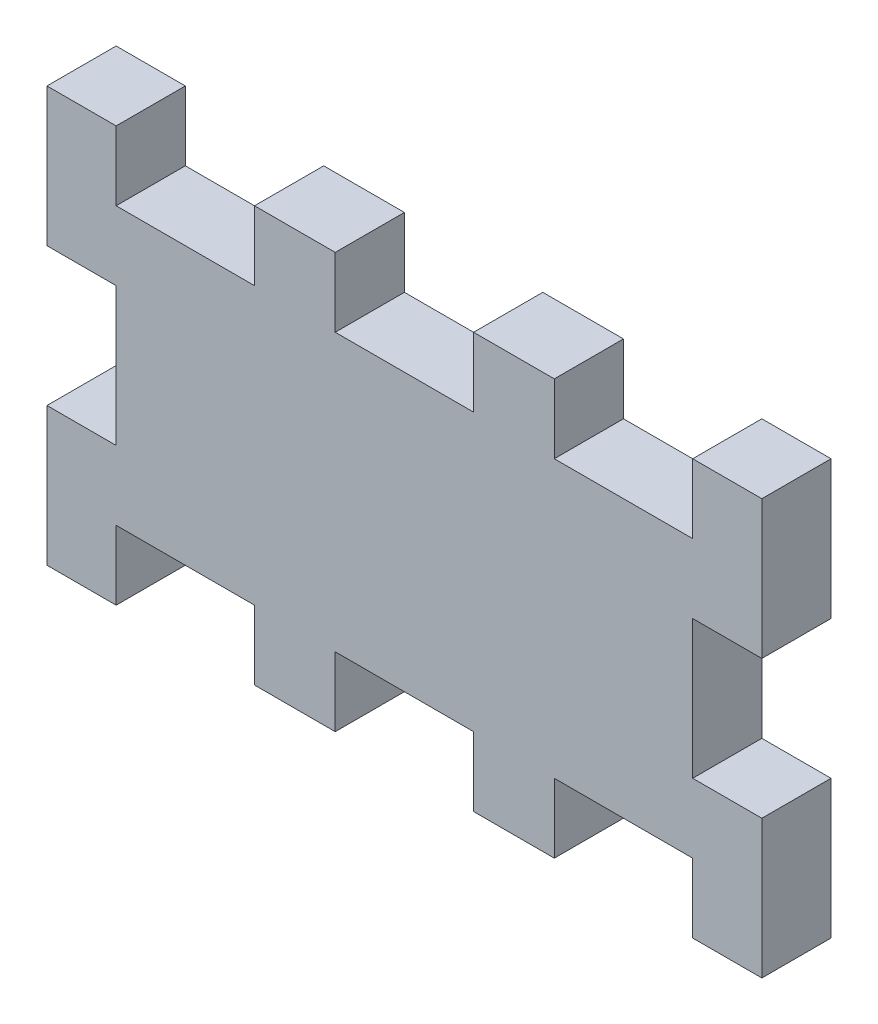
ISO-10303-21;
HEADER;
FILE_DESCRIPTION(('STEP AP214'),'2;1');
FILE_NAME('part.step','',(''),(''),'','','');
FILE_SCHEMA(('AUTOMOTIVE_DESIGN { 1 0 10303 214 1 1 1 1 }'));
ENDSEC;
DATA;
#1=APPLICATION_CONTEXT('core data for automotive mechanical design processes');
#2=APPLICATION_PROTOCOL_DEFINITION('international standard','automotive_design',2000,#1);
#3=PRODUCT_CONTEXT('',#1,'mechanical');
#4=PRODUCT('Part','Part','',(#3));
#5=PRODUCT_RELATED_PRODUCT_CATEGORY('part','',(#4));
#6=PRODUCT_DEFINITION_FORMATION('','',#4);
#7=PRODUCT_DEFINITION_CONTEXT('part definition',#1,'design');
#8=PRODUCT_DEFINITION('design','',#6,#7);
#9=PRODUCT_DEFINITION_SHAPE('','',#8);
#10=(LENGTH_UNIT() NAMED_UNIT(*) SI_UNIT(.MILLI.,.METRE.));
#11=(NAMED_UNIT(*) PLANE_ANGLE_UNIT() SI_UNIT($,.RADIAN.));
#12=(NAMED_UNIT(*) SI_UNIT($,.STERADIAN.) SOLID_ANGLE_UNIT());
#13=UNCERTAINTY_MEASURE_WITH_UNIT(LENGTH_MEASURE(1.E-05),#10,'distance_accuracy_value','');
#14=(GEOMETRIC_REPRESENTATION_CONTEXT(3) GLOBAL_UNCERTAINTY_ASSIGNED_CONTEXT((#13)) GLOBAL_UNIT_ASSIGNED_CONTEXT((#10,
#11,#12)) REPRESENTATION_CONTEXT('',''));
#15=CARTESIAN_POINT('',(0.,0.,0.));
#16=DIRECTION('',(0.,0.,1.));
#17=DIRECTION('',(1.,0.,0.));
#18=AXIS2_PLACEMENT_3D('',#15,#16,#17);
#19=CARTESIAN_POINT('',(-12.5,6.,3.));
#20=DIRECTION('',(-1.,0.,0.));
#21=DIRECTION('',(0.,-1.,0.));
#22=AXIS2_PLACEMENT_3D('',#19,#20,#21);
#23=PLANE('',#22);
#24=DIRECTION('',(0.,1.,0.));
#25=VECTOR('',#24,1.);
#26=CARTESIAN_POINT('',(-12.5,6.,0.));
#27=LINE('',#26,#25);
#28=CARTESIAN_POINT('',(-12.5,6.,0.));
#29=VERTEX_POINT('',#28);
#30=CARTESIAN_POINT('',(-12.5,9.,0.));
#31=VERTEX_POINT('',#30);
#32=EDGE_CURVE('E314',#29,#31,#27,.T.);
#33=ORIENTED_EDGE('',*,*,#32,.T.);
#34=DIRECTION('',(0.,0.,-1.));
#35=VECTOR('',#34,1.);
#36=CARTESIAN_POINT('',(-12.5,9.,3.));
#37=LINE('',#36,#35);
#38=CARTESIAN_POINT('',(-12.5,9.,3.));
#39=VERTEX_POINT('',#38);
#40=EDGE_CURVE('E11',#39,#31,#37,.T.);
#41=ORIENTED_EDGE('',*,*,#40,.F.);
#42=DIRECTION('',(0.,1.,0.));
#43=VECTOR('',#42,1.);
#44=CARTESIAN_POINT('',(-12.5,6.,3.));
#45=LINE('',#44,#43);
#46=CARTESIAN_POINT('',(-12.5,6.,3.));
#47=VERTEX_POINT('',#46);
#48=EDGE_CURVE('E420',#47,#39,#45,.T.);
#49=ORIENTED_EDGE('',*,*,#48,.F.);
#50=DIRECTION('',(0.,0.,-1.));
#51=VECTOR('',#50,1.);
#52=CARTESIAN_POINT('',(-12.5,6.,3.));
#53=LINE('',#52,#51);
#54=EDGE_CURVE('E310',#47,#29,#53,.T.);
#55=ORIENTED_EDGE('',*,*,#54,.T.);
#56=EDGE_LOOP('',(#33,#41,#49,#55));
#57=FACE_BOUND('',#56,.T.);
#58=ADVANCED_FACE('F45',(#57),#23,.F.);
#59=CARTESIAN_POINT('',(-12.5,9.,3.));
#60=DIRECTION('',(0.,-1.,0.));
#61=DIRECTION('',(1.,0.,0.));
#62=AXIS2_PLACEMENT_3D('',#59,#60,#61);
#63=PLANE('',#62);
#64=DIRECTION('',(-1.,0.,0.));
#65=VECTOR('',#64,1.);
#66=CARTESIAN_POINT('',(-12.5,9.,0.));
#67=LINE('',#66,#65);
#68=CARTESIAN_POINT('',(-15.5,9.,0.));
#69=VERTEX_POINT('',#68);
#70=EDGE_CURVE('E318',#31,#69,#67,.T.);
#71=ORIENTED_EDGE('',*,*,#70,.T.);
#72=DIRECTION('',(0.,0.,-1.));
#73=VECTOR('',#72,1.);
#74=CARTESIAN_POINT('',(-15.5,9.,3.));
#75=LINE('',#74,#73);
#76=CARTESIAN_POINT('',(-15.5,9.,3.));
#77=VERTEX_POINT('',#76);
#78=EDGE_CURVE('E54',#77,#69,#75,.T.);
#79=ORIENTED_EDGE('',*,*,#78,.F.);
#80=DIRECTION('',(-1.,0.,0.));
#81=VECTOR('',#80,1.);
#82=CARTESIAN_POINT('',(-12.5,9.,3.));
#83=LINE('',#82,#81);
#84=EDGE_CURVE('E189',#39,#77,#83,.T.);
#85=ORIENTED_EDGE('',*,*,#84,.F.);
#86=ORIENTED_EDGE('',*,*,#40,.T.);
#87=EDGE_LOOP('',(#71,#79,#85,#86));
#88=FACE_BOUND('',#87,.T.);
#89=ADVANCED_FACE('F682',(#88),#63,.F.);
#90=CARTESIAN_POINT('',(-15.5,3.,3.));
#91=DIRECTION('',(1.,0.,0.));
#92=DIRECTION('',(0.,0.,-1.));
#93=AXIS2_PLACEMENT_3D('',#90,#91,#92);
#94=PLANE('',#93);
#95=DIRECTION('',(0.,-1.,0.));
#96=VECTOR('',#95,1.);
#97=CARTESIAN_POINT('',(-15.5,3.,0.));
#98=LINE('',#97,#96);
#99=CARTESIAN_POINT('',(-15.5,3.,0.));
#100=VERTEX_POINT('',#99);
#101=EDGE_CURVE('E321',#69,#100,#98,.T.);
#102=ORIENTED_EDGE('',*,*,#101,.T.);
#103=DIRECTION('',(0.,0.,-1.));
#104=VECTOR('',#103,1.);
#105=CARTESIAN_POINT('',(-15.5,3.,3.));
#106=LINE('',#105,#104);
#107=CARTESIAN_POINT('',(-15.5,3.,3.));
#108=VERTEX_POINT('',#107);
#109=EDGE_CURVE('E543',#108,#100,#106,.T.);
#110=ORIENTED_EDGE('',*,*,#109,.F.);
#111=DIRECTION('',(0.,-1.,0.));
#112=VECTOR('',#111,1.);
#113=CARTESIAN_POINT('',(-15.5,3.,3.));
#114=LINE('',#113,#112);
#115=EDGE_CURVE('E553',#77,#108,#114,.T.);
#116=ORIENTED_EDGE('',*,*,#115,.F.);
#117=ORIENTED_EDGE('',*,*,#78,.T.);
#118=EDGE_LOOP('',(#102,#110,#116,#117));
#119=FACE_BOUND('',#118,.T.);
#120=ADVANCED_FACE('F551',(#119),#94,.F.);
#121=CARTESIAN_POINT('',(-12.5,3.,3.));
#122=DIRECTION('',(0.,1.,0.));
#123=DIRECTION('',(-1.,0.,0.));
#124=AXIS2_PLACEMENT_3D('',#121,#122,#123);
#125=PLANE('',#124);
#126=DIRECTION('',(1.,0.,0.));
#127=VECTOR('',#126,1.);
#128=CARTESIAN_POINT('',(-12.5,3.,0.));
#129=LINE('',#128,#127);
#130=CARTESIAN_POINT('',(-12.5,3.,0.));
#131=VERTEX_POINT('',#130);
#132=EDGE_CURVE('E324',#100,#131,#129,.T.);
#133=ORIENTED_EDGE('',*,*,#132,.T.);
#134=DIRECTION('',(0.,0.,-1.));
#135=VECTOR('',#134,1.);
#136=CARTESIAN_POINT('',(-12.5,3.,3.));
#137=LINE('',#136,#135);
#138=CARTESIAN_POINT('',(-12.5,3.,3.));
#139=VERTEX_POINT('',#138);
#140=EDGE_CURVE('E539',#139,#131,#137,.T.);
#141=ORIENTED_EDGE('',*,*,#140,.F.);
#142=DIRECTION('',(1.,0.,0.));
#143=VECTOR('',#142,1.);
#144=CARTESIAN_POINT('',(-12.5,3.,3.));
#145=LINE('',#144,#143);
#146=EDGE_CURVE('E572',#108,#139,#145,.T.);
#147=ORIENTED_EDGE('',*,*,#146,.F.);
#148=ORIENTED_EDGE('',*,*,#109,.T.);
#149=EDGE_LOOP('',(#133,#141,#147,#148));
#150=FACE_BOUND('',#149,.T.);
#151=ADVANCED_FACE('F562',(#150),#125,.F.);
#152=CARTESIAN_POINT('',(-12.5,3.,3.));
#153=DIRECTION('',(1.,0.,0.));
#154=DIRECTION('',(0.,0.,-1.));
#155=AXIS2_PLACEMENT_3D('',#152,#153,#154);
#156=PLANE('',#155);
#157=DIRECTION('',(0.,-1.,0.));
#158=VECTOR('',#157,1.);
#159=CARTESIAN_POINT('',(-12.5,3.,0.));
#160=LINE('',#159,#158);
#161=CARTESIAN_POINT('',(-12.5,-3.,0.));
#162=VERTEX_POINT('',#161);
#163=EDGE_CURVE('E327',#131,#162,#160,.T.);
#164=ORIENTED_EDGE('',*,*,#163,.T.);
#165=DIRECTION('',(0.,0.,-1.));
#166=VECTOR('',#165,1.);
#167=CARTESIAN_POINT('',(-12.5,-3.,3.));
#168=LINE('',#167,#166);
#169=CARTESIAN_POINT('',(-12.5,-3.,3.));
#170=VERTEX_POINT('',#169);
#171=EDGE_CURVE('E535',#170,#162,#168,.T.);
#172=ORIENTED_EDGE('',*,*,#171,.F.);
#173=DIRECTION('',(0.,-1.,0.));
#174=VECTOR('',#173,1.);
#175=CARTESIAN_POINT('',(-12.5,3.,3.));
#176=LINE('',#175,#174);
#177=EDGE_CURVE('E568',#139,#170,#176,.T.);
#178=ORIENTED_EDGE('',*,*,#177,.F.);
#179=ORIENTED_EDGE('',*,*,#140,.T.);
#180=EDGE_LOOP('',(#164,#172,#178,#179));
#181=FACE_BOUND('',#180,.T.);
#182=ADVANCED_FACE('F566',(#181),#156,.F.);
#183=CARTESIAN_POINT('',(-12.5,-3.,3.));
#184=DIRECTION('',(0.,-1.,0.));
#185=DIRECTION('',(1.,0.,0.));
#186=AXIS2_PLACEMENT_3D('',#183,#184,#185);
#187=PLANE('',#186);
#188=DIRECTION('',(-1.,0.,0.));
#189=VECTOR('',#188,1.);
#190=CARTESIAN_POINT('',(-12.5,-3.,0.));
#191=LINE('',#190,#189);
#192=CARTESIAN_POINT('',(-15.5,-3.,0.));
#193=VERTEX_POINT('',#192);
#194=EDGE_CURVE('E330',#162,#193,#191,.T.);
#195=ORIENTED_EDGE('',*,*,#194,.T.);
#196=DIRECTION('',(0.,0.,-1.));
#197=VECTOR('',#196,1.);
#198=CARTESIAN_POINT('',(-15.5,-3.,3.));
#199=LINE('',#198,#197);
#200=CARTESIAN_POINT('',(-15.5,-3.,3.));
#201=VERTEX_POINT('',#200);
#202=EDGE_CURVE('E531',#201,#193,#199,.T.);
#203=ORIENTED_EDGE('',*,*,#202,.F.);
#204=DIRECTION('',(-1.,0.,0.));
#205=VECTOR('',#204,1.);
#206=CARTESIAN_POINT('',(-12.5,-3.,3.));
#207=LINE('',#206,#205);
#208=EDGE_CURVE('E571',#170,#201,#207,.T.);
#209=ORIENTED_EDGE('',*,*,#208,.F.);
#210=ORIENTED_EDGE('',*,*,#171,.T.);
#211=EDGE_LOOP('',(#195,#203,#209,#210));
#212=FACE_BOUND('',#211,.T.);
#213=ADVANCED_FACE('F695',(#212),#187,.F.);
#214=CARTESIAN_POINT('',(-15.5,-3.,3.));
#215=DIRECTION('',(1.,0.,0.));
#216=DIRECTION('',(0.,0.,-1.));
#217=AXIS2_PLACEMENT_3D('',#214,#215,#216);
#218=PLANE('',#217);
#219=DIRECTION('',(0.,-1.,0.));
#220=VECTOR('',#219,1.);
#221=CARTESIAN_POINT('',(-15.5,-3.,0.));
#222=LINE('',#221,#220);
#223=CARTESIAN_POINT('',(-15.5,-9.,0.));
#224=VERTEX_POINT('',#223);
#225=EDGE_CURVE('E333',#193,#224,#222,.T.);
#226=ORIENTED_EDGE('',*,*,#225,.T.);
#227=DIRECTION('',(0.,0.,-1.));
#228=VECTOR('',#227,1.);
#229=CARTESIAN_POINT('',(-15.5,-9.,3.));
#230=LINE('',#229,#228);
#231=CARTESIAN_POINT('',(-15.5,-9.,3.));
#232=VERTEX_POINT('',#231);
#233=EDGE_CURVE('E527',#232,#224,#230,.T.);
#234=ORIENTED_EDGE('',*,*,#233,.F.);
#235=DIRECTION('',(0.,-1.,0.));
#236=VECTOR('',#235,1.);
#237=CARTESIAN_POINT('',(-15.5,-3.,3.));
#238=LINE('',#237,#236);
#239=EDGE_CURVE('E576',#201,#232,#238,.T.);
#240=ORIENTED_EDGE('',*,*,#239,.F.);
#241=ORIENTED_EDGE('',*,*,#202,.T.);
#242=EDGE_LOOP('',(#226,#234,#240,#241));
#243=FACE_BOUND('',#242,.T.);
#244=ADVANCED_FACE('F698',(#243),#218,.F.);
#245=CARTESIAN_POINT('',(-12.5,-9.,3.));
#246=DIRECTION('',(0.,1.,0.));
#247=DIRECTION('',(-1.,0.,0.));
#248=AXIS2_PLACEMENT_3D('',#245,#246,#247);
#249=PLANE('',#248);
#250=DIRECTION('',(1.,0.,0.));
#251=VECTOR('',#250,1.);
#252=CARTESIAN_POINT('',(-12.5,-9.,0.));
#253=LINE('',#252,#251);
#254=CARTESIAN_POINT('',(-12.5,-9.,0.));
#255=VERTEX_POINT('',#254);
#256=EDGE_CURVE('E336',#224,#255,#253,.T.);
#257=ORIENTED_EDGE('',*,*,#256,.T.);
#258=DIRECTION('',(0.,0.,-1.));
#259=VECTOR('',#258,1.);
#260=CARTESIAN_POINT('',(-12.5,-9.,3.));
#261=LINE('',#260,#259);
#262=CARTESIAN_POINT('',(-12.5,-9.,3.));
#263=VERTEX_POINT('',#262);
#264=EDGE_CURVE('E523',#263,#255,#261,.T.);
#265=ORIENTED_EDGE('',*,*,#264,.F.);
#266=DIRECTION('',(1.,0.,0.));
#267=VECTOR('',#266,1.);
#268=CARTESIAN_POINT('',(-12.5,-9.,3.));
#269=LINE('',#268,#267);
#270=EDGE_CURVE('E583',#232,#263,#269,.T.);
#271=ORIENTED_EDGE('',*,*,#270,.F.);
#272=ORIENTED_EDGE('',*,*,#233,.T.);
#273=EDGE_LOOP('',(#257,#265,#271,#272));
#274=FACE_BOUND('',#273,.T.);
#275=ADVANCED_FACE('F702',(#274),#249,.F.);
#276=CARTESIAN_POINT('',(-12.5,-6.,3.));
#277=DIRECTION('',(-1.,0.,0.));
#278=DIRECTION('',(0.,-1.,0.));
#279=AXIS2_PLACEMENT_3D('',#276,#277,#278);
#280=PLANE('',#279);
#281=DIRECTION('',(0.,1.,0.));
#282=VECTOR('',#281,1.);
#283=CARTESIAN_POINT('',(-12.5,-6.,0.));
#284=LINE('',#283,#282);
#285=CARTESIAN_POINT('',(-12.5,-6.,0.));
#286=VERTEX_POINT('',#285);
#287=EDGE_CURVE('E339',#255,#286,#284,.T.);
#288=ORIENTED_EDGE('',*,*,#287,.T.);
#289=DIRECTION('',(0.,0.,-1.));
#290=VECTOR('',#289,1.);
#291=CARTESIAN_POINT('',(-12.5,-6.,3.));
#292=LINE('',#291,#290);
#293=CARTESIAN_POINT('',(-12.5,-6.,3.));
#294=VERTEX_POINT('',#293);
#295=EDGE_CURVE('E519',#294,#286,#292,.T.);
#296=ORIENTED_EDGE('',*,*,#295,.F.);
#297=DIRECTION('',(0.,1.,0.));
#298=VECTOR('',#297,1.);
#299=CARTESIAN_POINT('',(-12.5,-6.,3.));
#300=LINE('',#299,#298);
#301=EDGE_CURVE('E586',#263,#294,#300,.T.);
#302=ORIENTED_EDGE('',*,*,#301,.F.);
#303=ORIENTED_EDGE('',*,*,#264,.T.);
#304=EDGE_LOOP('',(#288,#296,#302,#303));
#305=FACE_BOUND('',#304,.T.);
#306=ADVANCED_FACE('F706',(#305),#280,.F.);
#307=CARTESIAN_POINT('',(-12.5,-6.,3.));
#308=DIRECTION('',(0.,1.,0.));
#309=DIRECTION('',(0.,0.,1.));
#310=AXIS2_PLACEMENT_3D('',#307,#308,#309);
#311=PLANE('',#310);
#312=DIRECTION('',(1.,0.,0.));
#313=VECTOR('',#312,1.);
#314=CARTESIAN_POINT('',(-12.5,-6.,0.));
#315=LINE('',#314,#313);
#316=CARTESIAN_POINT('',(-6.5,-6.,0.));
#317=VERTEX_POINT('',#316);
#318=EDGE_CURVE('E342',#286,#317,#315,.T.);
#319=ORIENTED_EDGE('',*,*,#318,.T.);
#320=DIRECTION('',(0.,0.,-1.));
#321=VECTOR('',#320,1.);
#322=CARTESIAN_POINT('',(-6.5,-6.,3.));
#323=LINE('',#322,#321);
#324=CARTESIAN_POINT('',(-6.5,-6.,3.));
#325=VERTEX_POINT('',#324);
#326=EDGE_CURVE('E515',#325,#317,#323,.T.);
#327=ORIENTED_EDGE('',*,*,#326,.F.);
#328=DIRECTION('',(1.,0.,0.));
#329=VECTOR('',#328,1.);
#330=CARTESIAN_POINT('',(-12.5,-6.,3.));
#331=LINE('',#330,#329);
#332=EDGE_CURVE('E589',#294,#325,#331,.T.);
#333=ORIENTED_EDGE('',*,*,#332,.F.);
#334=ORIENTED_EDGE('',*,*,#295,.T.);
#335=EDGE_LOOP('',(#319,#327,#333,#334));
#336=FACE_BOUND('',#335,.T.);
#337=ADVANCED_FACE('F710',(#336),#311,.F.);
#338=CARTESIAN_POINT('',(-6.5,-6.,3.));
#339=DIRECTION('',(1.,0.,0.));
#340=DIRECTION('',(0.,1.,0.));
#341=AXIS2_PLACEMENT_3D('',#338,#339,#340);
#342=PLANE('',#341);
#343=DIRECTION('',(0.,-1.,0.));
#344=VECTOR('',#343,1.);
#345=CARTESIAN_POINT('',(-6.5,-6.,0.));
#346=LINE('',#345,#344);
#347=CARTESIAN_POINT('',(-6.5,-9.,0.));
#348=VERTEX_POINT('',#347);
#349=EDGE_CURVE('E345',#317,#348,#346,.T.);
#350=ORIENTED_EDGE('',*,*,#349,.T.);
#351=DIRECTION('',(0.,0.,-1.));
#352=VECTOR('',#351,1.);
#353=CARTESIAN_POINT('',(-6.5,-9.,3.));
#354=LINE('',#353,#352);
#355=CARTESIAN_POINT('',(-6.5,-9.,3.));
#356=VERTEX_POINT('',#355);
#357=EDGE_CURVE('E511',#356,#348,#354,.T.);
#358=ORIENTED_EDGE('',*,*,#357,.F.);
#359=DIRECTION('',(0.,-1.,0.));
#360=VECTOR('',#359,1.);
#361=CARTESIAN_POINT('',(-6.5,-6.,3.));
#362=LINE('',#361,#360);
#363=EDGE_CURVE('E592',#325,#356,#362,.T.);
#364=ORIENTED_EDGE('',*,*,#363,.F.);
#365=ORIENTED_EDGE('',*,*,#326,.T.);
#366=EDGE_LOOP('',(#350,#358,#364,#365));
#367=FACE_BOUND('',#366,.T.);
#368=ADVANCED_FACE('F714',(#367),#342,.F.);
#369=CARTESIAN_POINT('',(-3.,-9.,3.));
#370=DIRECTION('',(0.,1.,0.));
#371=DIRECTION('',(-1.,0.,0.));
#372=AXIS2_PLACEMENT_3D('',#369,#370,#371);
#373=PLANE('',#372);
#374=DIRECTION('',(1.,0.,0.));
#375=VECTOR('',#374,1.);
#376=CARTESIAN_POINT('',(-3.,-9.,0.));
#377=LINE('',#376,#375);
#378=CARTESIAN_POINT('',(-3.,-9.,0.));
#379=VERTEX_POINT('',#378);
#380=EDGE_CURVE('E348',#348,#379,#377,.T.);
#381=ORIENTED_EDGE('',*,*,#380,.T.);
#382=DIRECTION('',(0.,0.,-1.));
#383=VECTOR('',#382,1.);
#384=CARTESIAN_POINT('',(-3.,-9.,3.));
#385=LINE('',#384,#383);
#386=CARTESIAN_POINT('',(-3.,-9.,3.));
#387=VERTEX_POINT('',#386);
#388=EDGE_CURVE('E507',#387,#379,#385,.T.);
#389=ORIENTED_EDGE('',*,*,#388,.F.);
#390=DIRECTION('',(1.,0.,0.));
#391=VECTOR('',#390,1.);
#392=CARTESIAN_POINT('',(-3.,-9.,3.));
#393=LINE('',#392,#391);
#394=EDGE_CURVE('E595',#356,#387,#393,.T.);
#395=ORIENTED_EDGE('',*,*,#394,.F.);
#396=ORIENTED_EDGE('',*,*,#357,.T.);
#397=EDGE_LOOP('',(#381,#389,#395,#396));
#398=FACE_BOUND('',#397,.T.);
#399=ADVANCED_FACE('F718',(#398),#373,.F.);
#400=CARTESIAN_POINT('',(-3.,-6.,3.));
#401=DIRECTION('',(-1.,0.,0.));
#402=DIRECTION('',(0.,0.,1.));
#403=AXIS2_PLACEMENT_3D('',#400,#401,#402);
#404=PLANE('',#403);
#405=DIRECTION('',(0.,1.,0.));
#406=VECTOR('',#405,1.);
#407=CARTESIAN_POINT('',(-3.,-6.,0.));
#408=LINE('',#407,#406);
#409=CARTESIAN_POINT('',(-3.,-6.,0.));
#410=VERTEX_POINT('',#409);
#411=EDGE_CURVE('E351',#379,#410,#408,.T.);
#412=ORIENTED_EDGE('',*,*,#411,.T.);
#413=DIRECTION('',(0.,0.,-1.));
#414=VECTOR('',#413,1.);
#415=CARTESIAN_POINT('',(-3.,-6.,3.));
#416=LINE('',#415,#414);
#417=CARTESIAN_POINT('',(-3.,-6.,3.));
#418=VERTEX_POINT('',#417);
#419=EDGE_CURVE('E503',#418,#410,#416,.T.);
#420=ORIENTED_EDGE('',*,*,#419,.F.);
#421=DIRECTION('',(0.,1.,0.));
#422=VECTOR('',#421,1.);
#423=CARTESIAN_POINT('',(-3.,-6.,3.));
#424=LINE('',#423,#422);
#425=EDGE_CURVE('E598',#387,#418,#424,.T.);
#426=ORIENTED_EDGE('',*,*,#425,.F.);
#427=ORIENTED_EDGE('',*,*,#388,.T.);
#428=EDGE_LOOP('',(#412,#420,#426,#427));
#429=FACE_BOUND('',#428,.T.);
#430=ADVANCED_FACE('F722',(#429),#404,.F.);
#431=CARTESIAN_POINT('',(-3.,-6.,3.));
#432=DIRECTION('',(0.,1.,0.));
#433=DIRECTION('',(-1.,0.,0.));
#434=AXIS2_PLACEMENT_3D('',#431,#432,#433);
#435=PLANE('',#434);
#436=DIRECTION('',(1.,0.,0.));
#437=VECTOR('',#436,1.);
#438=CARTESIAN_POINT('',(-3.,-6.,0.));
#439=LINE('',#438,#437);
#440=CARTESIAN_POINT('',(3.,-5.99999999999999,0.));
#441=VERTEX_POINT('',#440);
#442=EDGE_CURVE('E354',#410,#441,#439,.T.);
#443=ORIENTED_EDGE('',*,*,#442,.T.);
#444=DIRECTION('',(0.,0.,-1.));
#445=VECTOR('',#444,1.);
#446=CARTESIAN_POINT('',(3.,-5.99999999999999,3.));
#447=LINE('',#446,#445);
#448=CARTESIAN_POINT('',(3.,-5.99999999999999,3.));
#449=VERTEX_POINT('',#448);
#450=EDGE_CURVE('E499',#449,#441,#447,.T.);
#451=ORIENTED_EDGE('',*,*,#450,.F.);
#452=DIRECTION('',(1.,0.,0.));
#453=VECTOR('',#452,1.);
#454=CARTESIAN_POINT('',(-3.,-6.,3.));
#455=LINE('',#454,#453);
#456=EDGE_CURVE('E601',#418,#449,#455,.T.);
#457=ORIENTED_EDGE('',*,*,#456,.F.);
#458=ORIENTED_EDGE('',*,*,#419,.T.);
#459=EDGE_LOOP('',(#443,#451,#457,#458));
#460=FACE_BOUND('',#459,.T.);
#461=ADVANCED_FACE('F726',(#460),#435,.F.);
#462=CARTESIAN_POINT('',(3.,-5.99999999999999,3.));
#463=DIRECTION('',(1.,0.,0.));
#464=DIRECTION('',(0.,0.,-1.));
#465=AXIS2_PLACEMENT_3D('',#462,#463,#464);
#466=PLANE('',#465);
#467=DIRECTION('',(0.,-1.,0.));
#468=VECTOR('',#467,1.);
#469=CARTESIAN_POINT('',(3.,-5.99999999999999,0.));
#470=LINE('',#469,#468);
#471=CARTESIAN_POINT('',(3.,-8.99999999999999,0.));
#472=VERTEX_POINT('',#471);
#473=EDGE_CURVE('E357',#441,#472,#470,.T.);
#474=ORIENTED_EDGE('',*,*,#473,.T.);
#475=DIRECTION('',(0.,0.,-1.));
#476=VECTOR('',#475,1.);
#477=CARTESIAN_POINT('',(3.,-8.99999999999999,3.));
#478=LINE('',#477,#476);
#479=CARTESIAN_POINT('',(3.,-8.99999999999999,3.));
#480=VERTEX_POINT('',#479);
#481=EDGE_CURVE('E495',#480,#472,#478,.T.);
#482=ORIENTED_EDGE('',*,*,#481,.F.);
#483=DIRECTION('',(0.,-1.,0.));
#484=VECTOR('',#483,1.);
#485=CARTESIAN_POINT('',(3.,-5.99999999999999,3.));
#486=LINE('',#485,#484);
#487=EDGE_CURVE('E604',#449,#480,#486,.T.);
#488=ORIENTED_EDGE('',*,*,#487,.F.);
#489=ORIENTED_EDGE('',*,*,#450,.T.);
#490=EDGE_LOOP('',(#474,#482,#488,#489));
#491=FACE_BOUND('',#490,.T.);
#492=ADVANCED_FACE('F730',(#491),#466,.F.);
#493=CARTESIAN_POINT('',(3.,-8.99999999999999,3.));
#494=DIRECTION('',(0.,1.,0.));
#495=DIRECTION('',(-1.,0.,0.));
#496=AXIS2_PLACEMENT_3D('',#493,#494,#495);
#497=PLANE('',#496);
#498=DIRECTION('',(1.,0.,0.));
#499=VECTOR('',#498,1.);
#500=CARTESIAN_POINT('',(3.,-8.99999999999999,0.));
#501=LINE('',#500,#499);
#502=CARTESIAN_POINT('',(6.5,-8.99999999999999,0.));
#503=VERTEX_POINT('',#502);
#504=EDGE_CURVE('E360',#472,#503,#501,.T.);
#505=ORIENTED_EDGE('',*,*,#504,.T.);
#506=DIRECTION('',(0.,0.,-1.));
#507=VECTOR('',#506,1.);
#508=CARTESIAN_POINT('',(6.5,-8.99999999999999,3.));
#509=LINE('',#508,#507);
#510=CARTESIAN_POINT('',(6.5,-8.99999999999999,3.));
#511=VERTEX_POINT('',#510);
#512=EDGE_CURVE('E491',#511,#503,#509,.T.);
#513=ORIENTED_EDGE('',*,*,#512,.F.);
#514=DIRECTION('',(1.,0.,0.));
#515=VECTOR('',#514,1.);
#516=CARTESIAN_POINT('',(3.,-8.99999999999999,3.));
#517=LINE('',#516,#515);
#518=EDGE_CURVE('E607',#480,#511,#517,.T.);
#519=ORIENTED_EDGE('',*,*,#518,.F.);
#520=ORIENTED_EDGE('',*,*,#481,.T.);
#521=EDGE_LOOP('',(#505,#513,#519,#520));
#522=FACE_BOUND('',#521,.T.);
#523=ADVANCED_FACE('F734',(#522),#497,.F.);
#524=CARTESIAN_POINT('',(6.5,-5.99999999999999,3.));
#525=DIRECTION('',(-1.,0.,0.));
#526=DIRECTION('',(0.,-1.,0.));
#527=AXIS2_PLACEMENT_3D('',#524,#525,#526);
#528=PLANE('',#527);
#529=DIRECTION('',(0.,1.,0.));
#530=VECTOR('',#529,1.);
#531=CARTESIAN_POINT('',(6.5,-5.99999999999999,0.));
#532=LINE('',#531,#530);
#533=CARTESIAN_POINT('',(6.5,-5.99999999999999,0.));
#534=VERTEX_POINT('',#533);
#535=EDGE_CURVE('E363',#503,#534,#532,.T.);
#536=ORIENTED_EDGE('',*,*,#535,.T.);
#537=DIRECTION('',(0.,0.,-1.));
#538=VECTOR('',#537,1.);
#539=CARTESIAN_POINT('',(6.5,-5.99999999999999,3.));
#540=LINE('',#539,#538);
#541=CARTESIAN_POINT('',(6.5,-5.99999999999999,3.));
#542=VERTEX_POINT('',#541);
#543=EDGE_CURVE('E487',#542,#534,#540,.T.);
#544=ORIENTED_EDGE('',*,*,#543,.F.);
#545=DIRECTION('',(0.,1.,0.));
#546=VECTOR('',#545,1.);
#547=CARTESIAN_POINT('',(6.5,-5.99999999999999,3.));
#548=LINE('',#547,#546);
#549=EDGE_CURVE('E610',#511,#542,#548,.T.);
#550=ORIENTED_EDGE('',*,*,#549,.F.);
#551=ORIENTED_EDGE('',*,*,#512,.T.);
#552=EDGE_LOOP('',(#536,#544,#550,#551));
#553=FACE_BOUND('',#552,.T.);
#554=ADVANCED_FACE('F738',(#553),#528,.F.);
#555=CARTESIAN_POINT('',(6.5,-5.99999999999999,3.));
#556=DIRECTION('',(0.,1.,0.));
#557=DIRECTION('',(-1.,0.,0.));
#558=AXIS2_PLACEMENT_3D('',#555,#556,#557);
#559=PLANE('',#558);
#560=DIRECTION('',(1.,0.,0.));
#561=VECTOR('',#560,1.);
#562=CARTESIAN_POINT('',(6.5,-5.99999999999999,0.));
#563=LINE('',#562,#561);
#564=CARTESIAN_POINT('',(12.5,-6.,0.));
#565=VERTEX_POINT('',#564);
#566=EDGE_CURVE('E366',#534,#565,#563,.T.);
#567=ORIENTED_EDGE('',*,*,#566,.T.);
#568=DIRECTION('',(0.,0.,-1.));
#569=VECTOR('',#568,1.);
#570=CARTESIAN_POINT('',(12.5,-6.,3.));
#571=LINE('',#570,#569);
#572=CARTESIAN_POINT('',(12.5,-6.,3.));
#573=VERTEX_POINT('',#572);
#574=EDGE_CURVE('E483',#573,#565,#571,.T.);
#575=ORIENTED_EDGE('',*,*,#574,.F.);
#576=DIRECTION('',(1.,0.,0.));
#577=VECTOR('',#576,1.);
#578=CARTESIAN_POINT('',(6.5,-5.99999999999999,3.));
#579=LINE('',#578,#577);
#580=EDGE_CURVE('E613',#542,#573,#579,.T.);
#581=ORIENTED_EDGE('',*,*,#580,.F.);
#582=ORIENTED_EDGE('',*,*,#543,.T.);
#583=EDGE_LOOP('',(#567,#575,#581,#582));
#584=FACE_BOUND('',#583,.T.);
#585=ADVANCED_FACE('F742',(#584),#559,.F.);
#586=CARTESIAN_POINT('',(12.5,-6.,3.));
#587=DIRECTION('',(1.,0.,0.));
#588=DIRECTION('',(0.,1.,0.));
#589=AXIS2_PLACEMENT_3D('',#586,#587,#588);
#590=PLANE('',#589);
#591=DIRECTION('',(0.,-1.,0.));
#592=VECTOR('',#591,1.);
#593=CARTESIAN_POINT('',(12.5,-6.,0.));
#594=LINE('',#593,#592);
#595=CARTESIAN_POINT('',(12.5,-8.99999999999999,0.));
#596=VERTEX_POINT('',#595);
#597=EDGE_CURVE('E369',#565,#596,#594,.T.);
#598=ORIENTED_EDGE('',*,*,#597,.T.);
#599=DIRECTION('',(0.,0.,-1.));
#600=VECTOR('',#599,1.);
#601=CARTESIAN_POINT('',(12.5,-8.99999999999999,3.));
#602=LINE('',#601,#600);
#603=CARTESIAN_POINT('',(12.5,-8.99999999999999,3.));
#604=VERTEX_POINT('',#603);
#605=EDGE_CURVE('E479',#604,#596,#602,.T.);
#606=ORIENTED_EDGE('',*,*,#605,.F.);
#607=DIRECTION('',(0.,-1.,0.));
#608=VECTOR('',#607,1.);
#609=CARTESIAN_POINT('',(12.5,-6.,3.));
#610=LINE('',#609,#608);
#611=EDGE_CURVE('E616',#573,#604,#610,.T.);
#612=ORIENTED_EDGE('',*,*,#611,.F.);
#613=ORIENTED_EDGE('',*,*,#574,.T.);
#614=EDGE_LOOP('',(#598,#606,#612,#613));
#615=FACE_BOUND('',#614,.T.);
#616=ADVANCED_FACE('F746',(#615),#590,.F.);
#617=CARTESIAN_POINT('',(12.5,-8.99999999999999,3.));
#618=DIRECTION('',(0.,1.,0.));
#619=DIRECTION('',(-1.,0.,0.));
#620=AXIS2_PLACEMENT_3D('',#617,#618,#619);
#621=PLANE('',#620);
#622=DIRECTION('',(1.,0.,0.));
#623=VECTOR('',#622,1.);
#624=CARTESIAN_POINT('',(12.5,-8.99999999999999,0.));
#625=LINE('',#624,#623);
#626=CARTESIAN_POINT('',(15.5,-8.99999999999999,0.));
#627=VERTEX_POINT('',#626);
#628=EDGE_CURVE('E372',#596,#627,#625,.T.);
#629=ORIENTED_EDGE('',*,*,#628,.T.);
#630=DIRECTION('',(0.,0.,-1.));
#631=VECTOR('',#630,1.);
#632=CARTESIAN_POINT('',(15.5,-8.99999999999999,3.));
#633=LINE('',#632,#631);
#634=CARTESIAN_POINT('',(15.5,-8.99999999999999,3.));
#635=VERTEX_POINT('',#634);
#636=EDGE_CURVE('E475',#635,#627,#633,.T.);
#637=ORIENTED_EDGE('',*,*,#636,.F.);
#638=DIRECTION('',(1.,0.,0.));
#639=VECTOR('',#638,1.);
#640=CARTESIAN_POINT('',(12.5,-8.99999999999999,3.));
#641=LINE('',#640,#639);
#642=EDGE_CURVE('E619',#604,#635,#641,.T.);
#643=ORIENTED_EDGE('',*,*,#642,.F.);
#644=ORIENTED_EDGE('',*,*,#605,.T.);
#645=EDGE_LOOP('',(#629,#637,#643,#644));
#646=FACE_BOUND('',#645,.T.);
#647=ADVANCED_FACE('F750',(#646),#621,.F.);
#648=CARTESIAN_POINT('',(15.5,-2.99999999999999,3.));
#649=DIRECTION('',(-1.,0.,0.));
#650=DIRECTION('',(0.,0.,1.));
#651=AXIS2_PLACEMENT_3D('',#648,#649,#650);
#652=PLANE('',#651);
#653=DIRECTION('',(0.,1.,0.));
#654=VECTOR('',#653,1.);
#655=CARTESIAN_POINT('',(15.5,-2.99999999999999,0.));
#656=LINE('',#655,#654);
#657=CARTESIAN_POINT('',(15.5,-2.99999999999999,0.));
#658=VERTEX_POINT('',#657);
#659=EDGE_CURVE('E375',#627,#658,#656,.T.);
#660=ORIENTED_EDGE('',*,*,#659,.T.);
#661=DIRECTION('',(0.,0.,-1.));
#662=VECTOR('',#661,1.);
#663=CARTESIAN_POINT('',(15.5,-2.99999999999999,3.));
#664=LINE('',#663,#662);
#665=CARTESIAN_POINT('',(15.5,-2.99999999999999,3.));
#666=VERTEX_POINT('',#665);
#667=EDGE_CURVE('E471',#666,#658,#664,.T.);
#668=ORIENTED_EDGE('',*,*,#667,.F.);
#669=DIRECTION('',(0.,1.,0.));
#670=VECTOR('',#669,1.);
#671=CARTESIAN_POINT('',(15.5,-2.99999999999999,3.));
#672=LINE('',#671,#670);
#673=EDGE_CURVE('E622',#635,#666,#672,.T.);
#674=ORIENTED_EDGE('',*,*,#673,.F.);
#675=ORIENTED_EDGE('',*,*,#636,.T.);
#676=EDGE_LOOP('',(#660,#668,#674,#675));
#677=FACE_BOUND('',#676,.T.);
#678=ADVANCED_FACE('F754',(#677),#652,.F.);
#679=CARTESIAN_POINT('',(12.5,-2.99999999999999,3.));
#680=DIRECTION('',(0.,-1.,0.));
#681=DIRECTION('',(1.,0.,0.));
#682=AXIS2_PLACEMENT_3D('',#679,#680,#681);
#683=PLANE('',#682);
#684=DIRECTION('',(-1.,0.,0.));
#685=VECTOR('',#684,1.);
#686=CARTESIAN_POINT('',(12.5,-2.99999999999999,0.));
#687=LINE('',#686,#685);
#688=CARTESIAN_POINT('',(12.5,-2.99999999999999,0.));
#689=VERTEX_POINT('',#688);
#690=EDGE_CURVE('E378',#658,#689,#687,.T.);
#691=ORIENTED_EDGE('',*,*,#690,.T.);
#692=DIRECTION('',(0.,0.,-1.));
#693=VECTOR('',#692,1.);
#694=CARTESIAN_POINT('',(12.5,-2.99999999999999,3.));
#695=LINE('',#694,#693);
#696=CARTESIAN_POINT('',(12.5,-2.99999999999999,3.));
#697=VERTEX_POINT('',#696);
#698=EDGE_CURVE('E467',#697,#689,#695,.T.);
#699=ORIENTED_EDGE('',*,*,#698,.F.);
#700=DIRECTION('',(-1.,0.,0.));
#701=VECTOR('',#700,1.);
#702=CARTESIAN_POINT('',(12.5,-2.99999999999999,3.));
#703=LINE('',#702,#701);
#704=EDGE_CURVE('E625',#666,#697,#703,.T.);
#705=ORIENTED_EDGE('',*,*,#704,.F.);
#706=ORIENTED_EDGE('',*,*,#667,.T.);
#707=EDGE_LOOP('',(#691,#699,#705,#706));
#708=FACE_BOUND('',#707,.T.);
#709=ADVANCED_FACE('F758',(#708),#683,.F.);
#710=CARTESIAN_POINT('',(12.5,3.00000000000001,3.));
#711=DIRECTION('',(-1.,0.,0.));
#712=DIRECTION('',(0.,0.,1.));
#713=AXIS2_PLACEMENT_3D('',#710,#711,#712);
#714=PLANE('',#713);
#715=DIRECTION('',(0.,1.,0.));
#716=VECTOR('',#715,1.);
#717=CARTESIAN_POINT('',(12.5,3.00000000000001,0.));
#718=LINE('',#717,#716);
#719=CARTESIAN_POINT('',(12.5,3.00000000000001,0.));
#720=VERTEX_POINT('',#719);
#721=EDGE_CURVE('E381',#689,#720,#718,.T.);
#722=ORIENTED_EDGE('',*,*,#721,.T.);
#723=DIRECTION('',(0.,0.,-1.));
#724=VECTOR('',#723,1.);
#725=CARTESIAN_POINT('',(12.5,3.00000000000001,3.));
#726=LINE('',#725,#724);
#727=CARTESIAN_POINT('',(12.5,3.00000000000001,3.));
#728=VERTEX_POINT('',#727);
#729=EDGE_CURVE('E463',#728,#720,#726,.T.);
#730=ORIENTED_EDGE('',*,*,#729,.F.);
#731=DIRECTION('',(0.,1.,0.));
#732=VECTOR('',#731,1.);
#733=CARTESIAN_POINT('',(12.5,3.00000000000001,3.));
#734=LINE('',#733,#732);
#735=EDGE_CURVE('E628',#697,#728,#734,.T.);
#736=ORIENTED_EDGE('',*,*,#735,.F.);
#737=ORIENTED_EDGE('',*,*,#698,.T.);
#738=EDGE_LOOP('',(#722,#730,#736,#737));
#739=FACE_BOUND('',#738,.T.);
#740=ADVANCED_FACE('F762',(#739),#714,.F.);
#741=CARTESIAN_POINT('',(12.5,3.00000000000001,3.));
#742=DIRECTION('',(0.,1.,0.));
#743=DIRECTION('',(-1.,0.,0.));
#744=AXIS2_PLACEMENT_3D('',#741,#742,#743);
#745=PLANE('',#744);
#746=DIRECTION('',(1.,0.,0.));
#747=VECTOR('',#746,1.);
#748=CARTESIAN_POINT('',(12.5,3.00000000000001,0.));
#749=LINE('',#748,#747);
#750=CARTESIAN_POINT('',(15.5,3.00000000000001,0.));
#751=VERTEX_POINT('',#750);
#752=EDGE_CURVE('E384',#720,#751,#749,.T.);
#753=ORIENTED_EDGE('',*,*,#752,.T.);
#754=DIRECTION('',(0.,0.,-1.));
#755=VECTOR('',#754,1.);
#756=CARTESIAN_POINT('',(15.5,3.00000000000001,3.));
#757=LINE('',#756,#755);
#758=CARTESIAN_POINT('',(15.5,3.00000000000001,3.));
#759=VERTEX_POINT('',#758);
#760=EDGE_CURVE('E459',#759,#751,#757,.T.);
#761=ORIENTED_EDGE('',*,*,#760,.F.);
#762=DIRECTION('',(1.,0.,0.));
#763=VECTOR('',#762,1.);
#764=CARTESIAN_POINT('',(12.5,3.00000000000001,3.));
#765=LINE('',#764,#763);
#766=EDGE_CURVE('E631',#728,#759,#765,.T.);
#767=ORIENTED_EDGE('',*,*,#766,.F.);
#768=ORIENTED_EDGE('',*,*,#729,.T.);
#769=EDGE_LOOP('',(#753,#761,#767,#768));
#770=FACE_BOUND('',#769,.T.);
#771=ADVANCED_FACE('F766',(#770),#745,.F.);
#772=CARTESIAN_POINT('',(15.5,3.00000000000001,3.));
#773=DIRECTION('',(-1.,0.,0.));
#774=DIRECTION('',(0.,0.,1.));
#775=AXIS2_PLACEMENT_3D('',#772,#773,#774);
#776=PLANE('',#775);
#777=DIRECTION('',(0.,1.,0.));
#778=VECTOR('',#777,1.);
#779=CARTESIAN_POINT('',(15.5,3.00000000000001,0.));
#780=LINE('',#779,#778);
#781=CARTESIAN_POINT('',(15.5,9.00000000000001,0.));
#782=VERTEX_POINT('',#781);
#783=EDGE_CURVE('E387',#751,#782,#780,.T.);
#784=ORIENTED_EDGE('',*,*,#783,.T.);
#785=DIRECTION('',(0.,0.,-1.));
#786=VECTOR('',#785,1.);
#787=CARTESIAN_POINT('',(15.5,9.00000000000001,3.));
#788=LINE('',#787,#786);
#789=CARTESIAN_POINT('',(15.5,9.00000000000001,3.));
#790=VERTEX_POINT('',#789);
#791=EDGE_CURVE('E455',#790,#782,#788,.T.);
#792=ORIENTED_EDGE('',*,*,#791,.F.);
#793=DIRECTION('',(0.,1.,0.));
#794=VECTOR('',#793,1.);
#795=CARTESIAN_POINT('',(15.5,3.00000000000001,3.));
#796=LINE('',#795,#794);
#797=EDGE_CURVE('E634',#759,#790,#796,.T.);
#798=ORIENTED_EDGE('',*,*,#797,.F.);
#799=ORIENTED_EDGE('',*,*,#760,.T.);
#800=EDGE_LOOP('',(#784,#792,#798,#799));
#801=FACE_BOUND('',#800,.T.);
#802=ADVANCED_FACE('F770',(#801),#776,.F.);
#803=CARTESIAN_POINT('',(12.5,9.,3.));
#804=DIRECTION('',(0.,-1.,0.));
#805=DIRECTION('',(1.,0.,0.));
#806=AXIS2_PLACEMENT_3D('',#803,#804,#805);
#807=PLANE('',#806);
#808=DIRECTION('',(-1.,0.,0.));
#809=VECTOR('',#808,1.);
#810=CARTESIAN_POINT('',(12.5,9.,0.));
#811=LINE('',#810,#809);
#812=CARTESIAN_POINT('',(12.5,9.,0.));
#813=VERTEX_POINT('',#812);
#814=EDGE_CURVE('E390',#782,#813,#811,.T.);
#815=ORIENTED_EDGE('',*,*,#814,.T.);
#816=DIRECTION('',(0.,0.,-1.));
#817=VECTOR('',#816,1.);
#818=CARTESIAN_POINT('',(12.5,9.,3.));
#819=LINE('',#818,#817);
#820=CARTESIAN_POINT('',(12.5,9.,3.));
#821=VERTEX_POINT('',#820);
#822=EDGE_CURVE('E451',#821,#813,#819,.T.);
#823=ORIENTED_EDGE('',*,*,#822,.F.);
#824=DIRECTION('',(-1.,0.,0.));
#825=VECTOR('',#824,1.);
#826=CARTESIAN_POINT('',(12.5,9.,3.));
#827=LINE('',#826,#825);
#828=EDGE_CURVE('E637',#790,#821,#827,.T.);
#829=ORIENTED_EDGE('',*,*,#828,.F.);
#830=ORIENTED_EDGE('',*,*,#791,.T.);
#831=EDGE_LOOP('',(#815,#823,#829,#830));
#832=FACE_BOUND('',#831,.T.);
#833=ADVANCED_FACE('F774',(#832),#807,.F.);
#834=CARTESIAN_POINT('',(12.5,6.,3.));
#835=DIRECTION('',(1.,0.,0.));
#836=DIRECTION('',(0.,1.,0.));
#837=AXIS2_PLACEMENT_3D('',#834,#835,#836);
#838=PLANE('',#837);
#839=DIRECTION('',(0.,-1.,0.));
#840=VECTOR('',#839,1.);
#841=CARTESIAN_POINT('',(12.5,6.,0.));
#842=LINE('',#841,#840);
#843=CARTESIAN_POINT('',(12.5,6.,0.));
#844=VERTEX_POINT('',#843);
#845=EDGE_CURVE('E393',#813,#844,#842,.T.);
#846=ORIENTED_EDGE('',*,*,#845,.T.);
#847=DIRECTION('',(0.,0.,-1.));
#848=VECTOR('',#847,1.);
#849=CARTESIAN_POINT('',(12.5,6.,3.));
#850=LINE('',#849,#848);
#851=CARTESIAN_POINT('',(12.5,6.,3.));
#852=VERTEX_POINT('',#851);
#853=EDGE_CURVE('E447',#852,#844,#850,.T.);
#854=ORIENTED_EDGE('',*,*,#853,.F.);
#855=DIRECTION('',(0.,-1.,0.));
#856=VECTOR('',#855,1.);
#857=CARTESIAN_POINT('',(12.5,6.,3.));
#858=LINE('',#857,#856);
#859=EDGE_CURVE('E640',#821,#852,#858,.T.);
#860=ORIENTED_EDGE('',*,*,#859,.F.);
#861=ORIENTED_EDGE('',*,*,#822,.T.);
#862=EDGE_LOOP('',(#846,#854,#860,#861));
#863=FACE_BOUND('',#862,.T.);
#864=ADVANCED_FACE('F778',(#863),#838,.F.);
#865=CARTESIAN_POINT('',(6.5,5.99999999999999,3.));
#866=DIRECTION('',(0.,-1.,0.));
#867=DIRECTION('',(1.,0.,0.));
#868=AXIS2_PLACEMENT_3D('',#865,#866,#867);
#869=PLANE('',#868);
#870=DIRECTION('',(-1.,0.,0.));
#871=VECTOR('',#870,1.);
#872=CARTESIAN_POINT('',(6.5,5.99999999999999,0.));
#873=LINE('',#872,#871);
#874=CARTESIAN_POINT('',(6.5,5.99999999999999,0.));
#875=VERTEX_POINT('',#874);
#876=EDGE_CURVE('E396',#844,#875,#873,.T.);
#877=ORIENTED_EDGE('',*,*,#876,.T.);
#878=DIRECTION('',(0.,0.,-1.));
#879=VECTOR('',#878,1.);
#880=CARTESIAN_POINT('',(6.5,5.99999999999999,3.));
#881=LINE('',#880,#879);
#882=CARTESIAN_POINT('',(6.5,5.99999999999999,3.));
#883=VERTEX_POINT('',#882);
#884=EDGE_CURVE('E443',#883,#875,#881,.T.);
#885=ORIENTED_EDGE('',*,*,#884,.F.);
#886=DIRECTION('',(-1.,0.,0.));
#887=VECTOR('',#886,1.);
#888=CARTESIAN_POINT('',(6.5,5.99999999999999,3.));
#889=LINE('',#888,#887);
#890=EDGE_CURVE('E643',#852,#883,#889,.T.);
#891=ORIENTED_EDGE('',*,*,#890,.F.);
#892=ORIENTED_EDGE('',*,*,#853,.T.);
#893=EDGE_LOOP('',(#877,#885,#891,#892));
#894=FACE_BOUND('',#893,.T.);
#895=ADVANCED_FACE('F782',(#894),#869,.F.);
#896=CARTESIAN_POINT('',(6.5,5.99999999999999,3.));
#897=DIRECTION('',(-1.,0.,0.));
#898=DIRECTION('',(0.,-1.,0.));
#899=AXIS2_PLACEMENT_3D('',#896,#897,#898);
#900=PLANE('',#899);
#901=DIRECTION('',(0.,1.,0.));
#902=VECTOR('',#901,1.);
#903=CARTESIAN_POINT('',(6.5,5.99999999999999,0.));
#904=LINE('',#903,#902);
#905=CARTESIAN_POINT('',(6.5,8.99999999999999,0.));
#906=VERTEX_POINT('',#905);
#907=EDGE_CURVE('E399',#875,#906,#904,.T.);
#908=ORIENTED_EDGE('',*,*,#907,.T.);
#909=DIRECTION('',(0.,0.,-1.));
#910=VECTOR('',#909,1.);
#911=CARTESIAN_POINT('',(6.5,8.99999999999999,3.));
#912=LINE('',#911,#910);
#913=CARTESIAN_POINT('',(6.5,8.99999999999999,3.));
#914=VERTEX_POINT('',#913);
#915=EDGE_CURVE('E439',#914,#906,#912,.T.);
#916=ORIENTED_EDGE('',*,*,#915,.F.);
#917=DIRECTION('',(0.,1.,0.));
#918=VECTOR('',#917,1.);
#919=CARTESIAN_POINT('',(6.5,5.99999999999999,3.));
#920=LINE('',#919,#918);
#921=EDGE_CURVE('E646',#883,#914,#920,.T.);
#922=ORIENTED_EDGE('',*,*,#921,.F.);
#923=ORIENTED_EDGE('',*,*,#884,.T.);
#924=EDGE_LOOP('',(#908,#916,#922,#923));
#925=FACE_BOUND('',#924,.T.);
#926=ADVANCED_FACE('F786',(#925),#900,.F.);
#927=CARTESIAN_POINT('',(3.,8.99999999999999,3.));
#928=DIRECTION('',(0.,-1.,0.));
#929=DIRECTION('',(1.,0.,0.));
#930=AXIS2_PLACEMENT_3D('',#927,#928,#929);
#931=PLANE('',#930);
#932=DIRECTION('',(-1.,0.,0.));
#933=VECTOR('',#932,1.);
#934=CARTESIAN_POINT('',(3.,8.99999999999999,0.));
#935=LINE('',#934,#933);
#936=CARTESIAN_POINT('',(3.,8.99999999999999,0.));
#937=VERTEX_POINT('',#936);
#938=EDGE_CURVE('E402',#906,#937,#935,.T.);
#939=ORIENTED_EDGE('',*,*,#938,.T.);
#940=DIRECTION('',(0.,0.,-1.));
#941=VECTOR('',#940,1.);
#942=CARTESIAN_POINT('',(3.,8.99999999999999,3.));
#943=LINE('',#942,#941);
#944=CARTESIAN_POINT('',(3.,8.99999999999999,3.));
#945=VERTEX_POINT('',#944);
#946=EDGE_CURVE('E435',#945,#937,#943,.T.);
#947=ORIENTED_EDGE('',*,*,#946,.F.);
#948=DIRECTION('',(-1.,0.,0.));
#949=VECTOR('',#948,1.);
#950=CARTESIAN_POINT('',(3.,8.99999999999999,3.));
#951=LINE('',#950,#949);
#952=EDGE_CURVE('E649',#914,#945,#951,.T.);
#953=ORIENTED_EDGE('',*,*,#952,.F.);
#954=ORIENTED_EDGE('',*,*,#915,.T.);
#955=EDGE_LOOP('',(#939,#947,#953,#954));
#956=FACE_BOUND('',#955,.T.);
#957=ADVANCED_FACE('F790',(#956),#931,.F.);
#958=CARTESIAN_POINT('',(3.,5.99999999999999,3.));
#959=DIRECTION('',(1.,0.,0.));
#960=DIRECTION('',(0.,0.,-1.));
#961=AXIS2_PLACEMENT_3D('',#958,#959,#960);
#962=PLANE('',#961);
#963=DIRECTION('',(0.,-1.,0.));
#964=VECTOR('',#963,1.);
#965=CARTESIAN_POINT('',(3.,5.99999999999999,0.));
#966=LINE('',#965,#964);
#967=CARTESIAN_POINT('',(3.,5.99999999999999,0.));
#968=VERTEX_POINT('',#967);
#969=EDGE_CURVE('E405',#937,#968,#966,.T.);
#970=ORIENTED_EDGE('',*,*,#969,.T.);
#971=DIRECTION('',(0.,0.,-1.));
#972=VECTOR('',#971,1.);
#973=CARTESIAN_POINT('',(3.,5.99999999999999,3.));
#974=LINE('',#973,#972);
#975=CARTESIAN_POINT('',(3.,5.99999999999999,3.));
#976=VERTEX_POINT('',#975);
#977=EDGE_CURVE('E431',#976,#968,#974,.T.);
#978=ORIENTED_EDGE('',*,*,#977,.F.);
#979=DIRECTION('',(0.,-1.,0.));
#980=VECTOR('',#979,1.);
#981=CARTESIAN_POINT('',(3.,5.99999999999999,3.));
#982=LINE('',#981,#980);
#983=EDGE_CURVE('E652',#945,#976,#982,.T.);
#984=ORIENTED_EDGE('',*,*,#983,.F.);
#985=ORIENTED_EDGE('',*,*,#946,.T.);
#986=EDGE_LOOP('',(#970,#978,#984,#985));
#987=FACE_BOUND('',#986,.T.);
#988=ADVANCED_FACE('F794',(#987),#962,.F.);
#989=CARTESIAN_POINT('',(-3.,6.,3.));
#990=DIRECTION('',(0.,-1.,0.));
#991=DIRECTION('',(1.,0.,0.));
#992=AXIS2_PLACEMENT_3D('',#989,#990,#991);
#993=PLANE('',#992);
#994=DIRECTION('',(-1.,0.,0.));
#995=VECTOR('',#994,1.);
#996=CARTESIAN_POINT('',(-3.,6.,0.));
#997=LINE('',#996,#995);
#998=CARTESIAN_POINT('',(-3.,6.,0.));
#999=VERTEX_POINT('',#998);
#1000=EDGE_CURVE('E408',#968,#999,#997,.T.);
#1001=ORIENTED_EDGE('',*,*,#1000,.T.);
#1002=DIRECTION('',(0.,0.,-1.));
#1003=VECTOR('',#1002,1.);
#1004=CARTESIAN_POINT('',(-3.,6.,3.));
#1005=LINE('',#1004,#1003);
#1006=CARTESIAN_POINT('',(-3.,6.,3.));
#1007=VERTEX_POINT('',#1006);
#1008=EDGE_CURVE('E427',#1007,#999,#1005,.T.);
#1009=ORIENTED_EDGE('',*,*,#1008,.F.);
#1010=DIRECTION('',(-1.,0.,0.));
#1011=VECTOR('',#1010,1.);
#1012=CARTESIAN_POINT('',(-3.,6.,3.));
#1013=LINE('',#1012,#1011);
#1014=EDGE_CURVE('E655',#976,#1007,#1013,.T.);
#1015=ORIENTED_EDGE('',*,*,#1014,.F.);
#1016=ORIENTED_EDGE('',*,*,#977,.T.);
#1017=EDGE_LOOP('',(#1001,#1009,#1015,#1016));
#1018=FACE_BOUND('',#1017,.T.);
#1019=ADVANCED_FACE('F663',(#1018),#993,.F.);
#1020=CARTESIAN_POINT('',(-3.,6.,3.));
#1021=DIRECTION('',(-1.,0.,0.));
#1022=DIRECTION('',(0.,0.,1.));
#1023=AXIS2_PLACEMENT_3D('',#1020,#1021,#1022);
#1024=PLANE('',#1023);
#1025=DIRECTION('',(0.,1.,0.));
#1026=VECTOR('',#1025,1.);
#1027=CARTESIAN_POINT('',(-3.,6.,0.));
#1028=LINE('',#1027,#1026);
#1029=CARTESIAN_POINT('',(-3.,9.,0.));
#1030=VERTEX_POINT('',#1029);
#1031=EDGE_CURVE('E411',#999,#1030,#1028,.T.);
#1032=ORIENTED_EDGE('',*,*,#1031,.T.);
#1033=DIRECTION('',(0.,0.,-1.));
#1034=VECTOR('',#1033,1.);
#1035=CARTESIAN_POINT('',(-3.,9.,3.));
#1036=LINE('',#1035,#1034);
#1037=CARTESIAN_POINT('',(-3.,9.,3.));
#1038=VERTEX_POINT('',#1037);
#1039=EDGE_CURVE('E303',#1038,#1030,#1036,.T.);
#1040=ORIENTED_EDGE('',*,*,#1039,.F.);
#1041=DIRECTION('',(0.,1.,0.));
#1042=VECTOR('',#1041,1.);
#1043=CARTESIAN_POINT('',(-3.,6.,3.));
#1044=LINE('',#1043,#1042);
#1045=EDGE_CURVE('E292',#1007,#1038,#1044,.T.);
#1046=ORIENTED_EDGE('',*,*,#1045,.F.);
#1047=ORIENTED_EDGE('',*,*,#1008,.T.);
#1048=EDGE_LOOP('',(#1032,#1040,#1046,#1047));
#1049=FACE_BOUND('',#1048,.T.);
#1050=ADVANCED_FACE('F667',(#1049),#1024,.F.);
#1051=CARTESIAN_POINT('',(-3.,9.,3.));
#1052=DIRECTION('',(0.,-1.,0.));
#1053=DIRECTION('',(1.,0.,0.));
#1054=AXIS2_PLACEMENT_3D('',#1051,#1052,#1053);
#1055=PLANE('',#1054);
#1056=DIRECTION('',(-1.,0.,0.));
#1057=VECTOR('',#1056,1.);
#1058=CARTESIAN_POINT('',(-3.,9.,0.));
#1059=LINE('',#1058,#1057);
#1060=CARTESIAN_POINT('',(-6.5,9.,0.));
#1061=VERTEX_POINT('',#1060);
#1062=EDGE_CURVE('E301',#1030,#1061,#1059,.T.);
#1063=ORIENTED_EDGE('',*,*,#1062,.T.);
#1064=DIRECTION('',(0.,0.,-1.));
#1065=VECTOR('',#1064,1.);
#1066=CARTESIAN_POINT('',(-6.5,9.,3.));
#1067=LINE('',#1066,#1065);
#1068=CARTESIAN_POINT('',(-6.5,9.,3.));
#1069=VERTEX_POINT('',#1068);
#1070=EDGE_CURVE('E298',#1069,#1061,#1067,.T.);
#1071=ORIENTED_EDGE('',*,*,#1070,.F.);
#1072=DIRECTION('',(-1.,0.,0.));
#1073=VECTOR('',#1072,1.);
#1074=CARTESIAN_POINT('',(-3.,9.,3.));
#1075=LINE('',#1074,#1073);
#1076=EDGE_CURVE('E286',#1038,#1069,#1075,.T.);
#1077=ORIENTED_EDGE('',*,*,#1076,.F.);
#1078=ORIENTED_EDGE('',*,*,#1039,.T.);
#1079=EDGE_LOOP('',(#1063,#1071,#1077,#1078));
#1080=FACE_BOUND('',#1079,.T.);
#1081=ADVANCED_FACE('F299',(#1080),#1055,.F.);
#1082=CARTESIAN_POINT('',(-6.5,6.,3.));
#1083=DIRECTION('',(1.,0.,0.));
#1084=DIRECTION('',(0.,1.,0.));
#1085=AXIS2_PLACEMENT_3D('',#1082,#1083,#1084);
#1086=PLANE('',#1085);
#1087=DIRECTION('',(0.,-1.,0.));
#1088=VECTOR('',#1087,1.);
#1089=CARTESIAN_POINT('',(-6.5,6.,0.));
#1090=LINE('',#1089,#1088);
#1091=CARTESIAN_POINT('',(-6.5,6.,0.));
#1092=VERTEX_POINT('',#1091);
#1093=EDGE_CURVE('E175',#1061,#1092,#1090,.T.);
#1094=ORIENTED_EDGE('',*,*,#1093,.T.);
#1095=DIRECTION('',(0.,0.,-1.));
#1096=VECTOR('',#1095,1.);
#1097=CARTESIAN_POINT('',(-6.5,6.,3.));
#1098=LINE('',#1097,#1096);
#1099=CARTESIAN_POINT('',(-6.5,6.,3.));
#1100=VERTEX_POINT('',#1099);
#1101=EDGE_CURVE('E304',#1100,#1092,#1098,.T.);
#1102=ORIENTED_EDGE('',*,*,#1101,.F.);
#1103=DIRECTION('',(0.,-1.,0.));
#1104=VECTOR('',#1103,1.);
#1105=CARTESIAN_POINT('',(-6.5,6.,3.));
#1106=LINE('',#1105,#1104);
#1107=EDGE_CURVE('E290',#1069,#1100,#1106,.T.);
#1108=ORIENTED_EDGE('',*,*,#1107,.F.);
#1109=ORIENTED_EDGE('',*,*,#1070,.T.);
#1110=EDGE_LOOP('',(#1094,#1102,#1108,#1109));
#1111=FACE_BOUND('',#1110,.T.);
#1112=ADVANCED_FACE('F306',(#1111),#1086,.F.);
#1113=CARTESIAN_POINT('',(-12.5,6.,3.));
#1114=DIRECTION('',(0.,-1.,0.));
#1115=DIRECTION('',(0.,0.,-1.));
#1116=AXIS2_PLACEMENT_3D('',#1113,#1114,#1115);
#1117=PLANE('',#1116);
#1118=DIRECTION('',(-1.,0.,0.));
#1119=VECTOR('',#1118,1.);
#1120=CARTESIAN_POINT('',(-12.5,6.,0.));
#1121=LINE('',#1120,#1119);
#1122=EDGE_CURVE('E181',#1092,#29,#1121,.T.);
#1123=ORIENTED_EDGE('',*,*,#1122,.T.);
#1124=ORIENTED_EDGE('',*,*,#54,.F.);
#1125=DIRECTION('',(-1.,0.,0.));
#1126=VECTOR('',#1125,1.);
#1127=CARTESIAN_POINT('',(-12.5,6.,3.));
#1128=LINE('',#1127,#1126);
#1129=EDGE_CURVE('E62',#1100,#47,#1128,.T.);
#1130=ORIENTED_EDGE('',*,*,#1129,.F.);
#1131=ORIENTED_EDGE('',*,*,#1101,.T.);
#1132=EDGE_LOOP('',(#1123,#1124,#1130,#1131));
#1133=FACE_BOUND('',#1132,.T.);
#1134=ADVANCED_FACE('F671',(#1133),#1117,.F.);
#1135=CARTESIAN_POINT('',(0.,0.,3.));
#1136=DIRECTION('',(0.,0.,1.));
#1137=DIRECTION('',(1.,0.,0.));
#1138=AXIS2_PLACEMENT_3D('',#1135,#1136,#1137);
#1139=PLANE('',#1138);
#1140=ORIENTED_EDGE('',*,*,#48,.T.);
#1141=ORIENTED_EDGE('',*,*,#84,.T.);
#1142=ORIENTED_EDGE('',*,*,#115,.T.);
#1143=ORIENTED_EDGE('',*,*,#146,.T.);
#1144=ORIENTED_EDGE('',*,*,#177,.T.);
#1145=ORIENTED_EDGE('',*,*,#208,.T.);
#1146=ORIENTED_EDGE('',*,*,#239,.T.);
#1147=ORIENTED_EDGE('',*,*,#270,.T.);
#1148=ORIENTED_EDGE('',*,*,#301,.T.);
#1149=ORIENTED_EDGE('',*,*,#332,.T.);
#1150=ORIENTED_EDGE('',*,*,#363,.T.);
#1151=ORIENTED_EDGE('',*,*,#394,.T.);
#1152=ORIENTED_EDGE('',*,*,#425,.T.);
#1153=ORIENTED_EDGE('',*,*,#456,.T.);
#1154=ORIENTED_EDGE('',*,*,#487,.T.);
#1155=ORIENTED_EDGE('',*,*,#518,.T.);
#1156=ORIENTED_EDGE('',*,*,#549,.T.);
#1157=ORIENTED_EDGE('',*,*,#580,.T.);
#1158=ORIENTED_EDGE('',*,*,#611,.T.);
#1159=ORIENTED_EDGE('',*,*,#642,.T.);
#1160=ORIENTED_EDGE('',*,*,#673,.T.);
#1161=ORIENTED_EDGE('',*,*,#704,.T.);
#1162=ORIENTED_EDGE('',*,*,#735,.T.);
#1163=ORIENTED_EDGE('',*,*,#766,.T.);
#1164=ORIENTED_EDGE('',*,*,#797,.T.);
#1165=ORIENTED_EDGE('',*,*,#828,.T.);
#1166=ORIENTED_EDGE('',*,*,#859,.T.);
#1167=ORIENTED_EDGE('',*,*,#890,.T.);
#1168=ORIENTED_EDGE('',*,*,#921,.T.);
#1169=ORIENTED_EDGE('',*,*,#952,.T.);
#1170=ORIENTED_EDGE('',*,*,#983,.T.);
#1171=ORIENTED_EDGE('',*,*,#1014,.T.);
#1172=ORIENTED_EDGE('',*,*,#1045,.T.);
#1173=ORIENTED_EDGE('',*,*,#1076,.T.);
#1174=ORIENTED_EDGE('',*,*,#1107,.T.);
#1175=ORIENTED_EDGE('',*,*,#1129,.T.);
#1176=EDGE_LOOP('',(#1140,#1141,#1142,#1143,#1144,#1145,#1146,#1147,#1148,#1149,#1150,#1151,
#1152,#1153,#1154,#1155,#1156,#1157,#1158,#1159,#1160,#1161,#1162,#1163,#1164,#1165,#1166,#1167,
#1168,#1169,#1170,#1171,#1172,#1173,#1174,#1175));
#1177=FACE_BOUND('',#1176,.T.);
#1178=ADVANCED_FACE('F288',(#1177),#1139,.T.);
#1179=CARTESIAN_POINT('',(0.,0.,0.));
#1180=DIRECTION('',(0.,0.,1.));
#1181=DIRECTION('',(1.,0.,0.));
#1182=AXIS2_PLACEMENT_3D('',#1179,#1180,#1181);
#1183=PLANE('',#1182);
#1184=ORIENTED_EDGE('',*,*,#32,.F.);
#1185=ORIENTED_EDGE('',*,*,#1122,.F.);
#1186=ORIENTED_EDGE('',*,*,#1093,.F.);
#1187=ORIENTED_EDGE('',*,*,#1062,.F.);
#1188=ORIENTED_EDGE('',*,*,#1031,.F.);
#1189=ORIENTED_EDGE('',*,*,#1000,.F.);
#1190=ORIENTED_EDGE('',*,*,#969,.F.);
#1191=ORIENTED_EDGE('',*,*,#938,.F.);
#1192=ORIENTED_EDGE('',*,*,#907,.F.);
#1193=ORIENTED_EDGE('',*,*,#876,.F.);
#1194=ORIENTED_EDGE('',*,*,#845,.F.);
#1195=ORIENTED_EDGE('',*,*,#814,.F.);
#1196=ORIENTED_EDGE('',*,*,#783,.F.);
#1197=ORIENTED_EDGE('',*,*,#752,.F.);
#1198=ORIENTED_EDGE('',*,*,#721,.F.);
#1199=ORIENTED_EDGE('',*,*,#690,.F.);
#1200=ORIENTED_EDGE('',*,*,#659,.F.);
#1201=ORIENTED_EDGE('',*,*,#628,.F.);
#1202=ORIENTED_EDGE('',*,*,#597,.F.);
#1203=ORIENTED_EDGE('',*,*,#566,.F.);
#1204=ORIENTED_EDGE('',*,*,#535,.F.);
#1205=ORIENTED_EDGE('',*,*,#504,.F.);
#1206=ORIENTED_EDGE('',*,*,#473,.F.);
#1207=ORIENTED_EDGE('',*,*,#442,.F.);
#1208=ORIENTED_EDGE('',*,*,#411,.F.);
#1209=ORIENTED_EDGE('',*,*,#380,.F.);
#1210=ORIENTED_EDGE('',*,*,#349,.F.);
#1211=ORIENTED_EDGE('',*,*,#318,.F.);
#1212=ORIENTED_EDGE('',*,*,#287,.F.);
#1213=ORIENTED_EDGE('',*,*,#256,.F.);
#1214=ORIENTED_EDGE('',*,*,#225,.F.);
#1215=ORIENTED_EDGE('',*,*,#194,.F.);
#1216=ORIENTED_EDGE('',*,*,#163,.F.);
#1217=ORIENTED_EDGE('',*,*,#132,.F.);
#1218=ORIENTED_EDGE('',*,*,#101,.F.);
#1219=ORIENTED_EDGE('',*,*,#70,.F.);
#1220=EDGE_LOOP('',(#1184,#1185,#1186,#1187,#1188,#1189,#1190,#1191,#1192,#1193,#1194,#1195,
#1196,#1197,#1198,#1199,#1200,#1201,#1202,#1203,#1204,#1205,#1206,#1207,#1208,#1209,#1210,#1211,
#1212,#1213,#1214,#1215,#1216,#1217,#1218,#1219));
#1221=FACE_BOUND('',#1220,.T.);
#1222=ADVANCED_FACE('F557',(#1221),#1183,.F.);
#1223=CLOSED_SHELL('',(#58,#89,#120,#151,#182,#213,#244,#275,#306,#337,#368,#399,#430,#461,#492,
#523,#554,#585,#616,#647,#678,#709,#740,#771,#802,#833,#864,#895,#926,#957,#988,#1019,#1050,
#1081,#1112,#1134,#1178,#1222));
#1224=MANIFOLD_SOLID_BREP('B2',#1223);
#1225=ADVANCED_BREP_SHAPE_REPRESENTATION('',(#18,#1224),#14);
#1226=SHAPE_DEFINITION_REPRESENTATION(#9,#1225);
ENDSEC;
END-ISO-10303-21;
